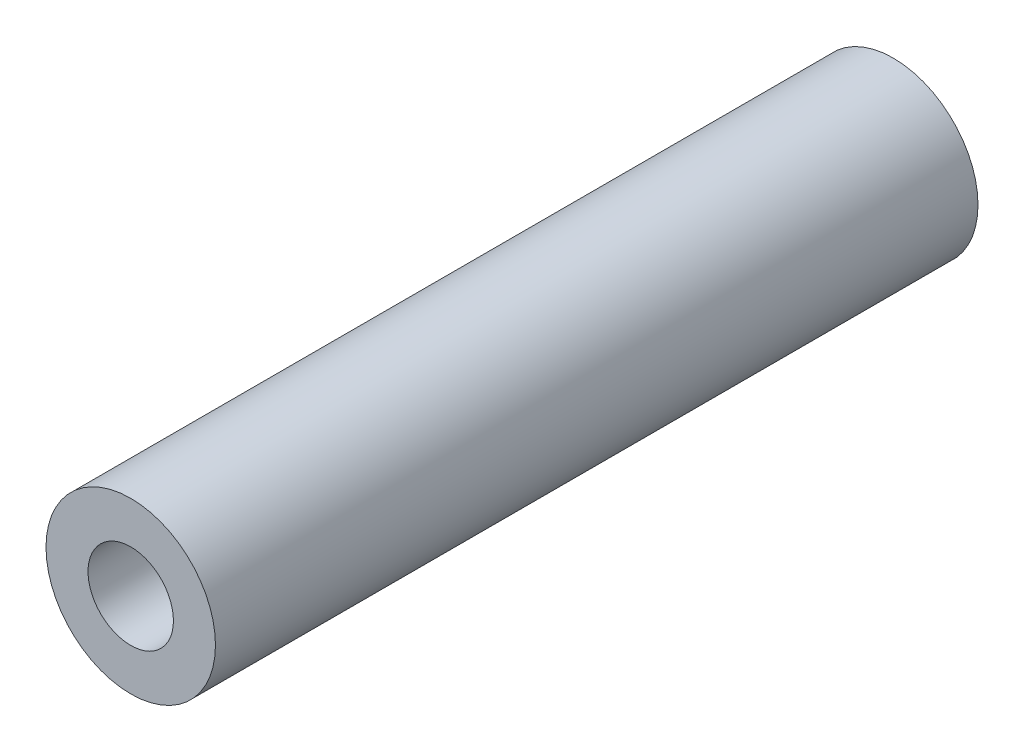
ISO-10303-21;
HEADER;
FILE_DESCRIPTION(('STEP AP214'),'2;1');
FILE_NAME('part.step','',(''),(''),'','','');
FILE_SCHEMA(('AUTOMOTIVE_DESIGN { 1 0 10303 214 1 1 1 1 }'));
ENDSEC;
DATA;
#1=APPLICATION_CONTEXT('core data for automotive mechanical design processes');
#2=APPLICATION_PROTOCOL_DEFINITION('international standard','automotive_design',2000,#1);
#3=PRODUCT_CONTEXT('',#1,'mechanical');
#4=PRODUCT('Part','Part','',(#3));
#5=PRODUCT_RELATED_PRODUCT_CATEGORY('part','',(#4));
#6=PRODUCT_DEFINITION_FORMATION('','',#4);
#7=PRODUCT_DEFINITION_CONTEXT('part definition',#1,'design');
#8=PRODUCT_DEFINITION('design','',#6,#7);
#9=PRODUCT_DEFINITION_SHAPE('','',#8);
#10=(LENGTH_UNIT() NAMED_UNIT(*) SI_UNIT(.MILLI.,.METRE.));
#11=(NAMED_UNIT(*) PLANE_ANGLE_UNIT() SI_UNIT($,.RADIAN.));
#12=(NAMED_UNIT(*) SI_UNIT($,.STERADIAN.) SOLID_ANGLE_UNIT());
#13=UNCERTAINTY_MEASURE_WITH_UNIT(LENGTH_MEASURE(1.E-05),#10,'distance_accuracy_value','');
#14=(GEOMETRIC_REPRESENTATION_CONTEXT(3) GLOBAL_UNCERTAINTY_ASSIGNED_CONTEXT((#13)) GLOBAL_UNIT_ASSIGNED_CONTEXT((#10,
#11,#12)) REPRESENTATION_CONTEXT('',''));
#15=CARTESIAN_POINT('',(0.,0.,0.));
#16=DIRECTION('',(0.,0.,1.));
#17=DIRECTION('',(1.,0.,0.));
#18=AXIS2_PLACEMENT_3D('',#15,#16,#17);
#19=CARTESIAN_POINT('',(0.,0.,28.575));
#20=DIRECTION('',(0.,0.,1.));
#21=DIRECTION('',(1.,0.,0.));
#22=AXIS2_PLACEMENT_3D('',#19,#20,#21);
#23=PLANE('',#22);
#24=CARTESIAN_POINT('',(0.,0.,28.575));
#25=DIRECTION('',(0.,0.,1.));
#26=DIRECTION('',(1.,0.,0.));
#27=AXIS2_PLACEMENT_3D('',#24,#25,#26);
#28=CIRCLE('',#27,6.35);
#29=CARTESIAN_POINT('',(6.35,0.,28.575));
#30=VERTEX_POINT('',#29);
#31=EDGE_CURVE('E10',#30,#30,#28,.T.);
#32=ORIENTED_EDGE('',*,*,#31,.T.);
#33=EDGE_LOOP('',(#32));
#34=FACE_BOUND('',#33,.T.);
#35=CARTESIAN_POINT('',(0.,0.,28.575));
#36=DIRECTION('',(0.,0.,1.));
#37=DIRECTION('',(1.,0.,0.));
#38=AXIS2_PLACEMENT_3D('',#35,#36,#37);
#39=CIRCLE('',#38,3.2004);
#40=CARTESIAN_POINT('',(3.2004,0.,28.575));
#41=VERTEX_POINT('',#40);
#42=EDGE_CURVE('E46',#41,#41,#39,.T.);
#43=ORIENTED_EDGE('',*,*,#42,.F.);
#44=EDGE_LOOP('',(#43));
#45=FACE_BOUND('',#44,.T.);
#46=ADVANCED_FACE('F35',(#34,#45),#23,.T.);
#47=CARTESIAN_POINT('',(0.,0.,-28.575));
#48=DIRECTION('',(0.,0.,1.));
#49=DIRECTION('',(1.,0.,0.));
#50=AXIS2_PLACEMENT_3D('',#47,#48,#49);
#51=PLANE('',#50);
#52=CARTESIAN_POINT('',(0.,0.,-28.575));
#53=DIRECTION('',(0.,0.,1.));
#54=DIRECTION('',(1.,0.,0.));
#55=AXIS2_PLACEMENT_3D('',#52,#53,#54);
#56=CIRCLE('',#55,6.35);
#57=CARTESIAN_POINT('',(6.35,0.,-28.575));
#58=VERTEX_POINT('',#57);
#59=EDGE_CURVE('E39',#58,#58,#56,.T.);
#60=ORIENTED_EDGE('',*,*,#59,.F.);
#61=EDGE_LOOP('',(#60));
#62=FACE_BOUND('',#61,.T.);
#63=CARTESIAN_POINT('',(0.,0.,-28.575));
#64=DIRECTION('',(0.,0.,1.));
#65=DIRECTION('',(1.,0.,0.));
#66=AXIS2_PLACEMENT_3D('',#63,#64,#65);
#67=CIRCLE('',#66,3.2004);
#68=CARTESIAN_POINT('',(3.2004,0.,-28.575));
#69=VERTEX_POINT('',#68);
#70=EDGE_CURVE('E48',#69,#69,#67,.T.);
#71=ORIENTED_EDGE('',*,*,#70,.T.);
#72=EDGE_LOOP('',(#71));
#73=FACE_BOUND('',#72,.T.);
#74=ADVANCED_FACE('F58',(#62,#73),#51,.F.);
#75=CARTESIAN_POINT('',(0.,0.,28.575));
#76=DIRECTION('',(0.,0.,-1.));
#77=DIRECTION('',(-1.,0.,0.));
#78=AXIS2_PLACEMENT_3D('',#75,#76,#77);
#79=CYLINDRICAL_SURFACE('',#78,6.35);
#80=ORIENTED_EDGE('',*,*,#31,.F.);
#81=EDGE_LOOP('',(#80));
#82=FACE_BOUND('',#81,.T.);
#83=ORIENTED_EDGE('',*,*,#59,.T.);
#84=EDGE_LOOP('',(#83));
#85=FACE_BOUND('',#84,.T.);
#86=ADVANCED_FACE('F37',(#82,#85),#79,.T.);
#87=CARTESIAN_POINT('',(0.,0.,28.575));
#88=DIRECTION('',(0.,0.,-1.));
#89=DIRECTION('',(-1.,0.,0.));
#90=AXIS2_PLACEMENT_3D('',#87,#88,#89);
#91=CYLINDRICAL_SURFACE('',#90,3.2004);
#92=ORIENTED_EDGE('',*,*,#42,.T.);
#93=EDGE_LOOP('',(#92));
#94=FACE_BOUND('',#93,.T.);
#95=ORIENTED_EDGE('',*,*,#70,.F.);
#96=EDGE_LOOP('',(#95));
#97=FACE_BOUND('',#96,.T.);
#98=ADVANCED_FACE('F54',(#94,#97),#91,.F.);
#99=CLOSED_SHELL('',(#46,#74,#86,#98));
#100=MANIFOLD_SOLID_BREP('B2',#99);
#101=ADVANCED_BREP_SHAPE_REPRESENTATION('',(#18,#100),#14);
#102=SHAPE_DEFINITION_REPRESENTATION(#9,#101);
ENDSEC;
END-ISO-10303-21;
